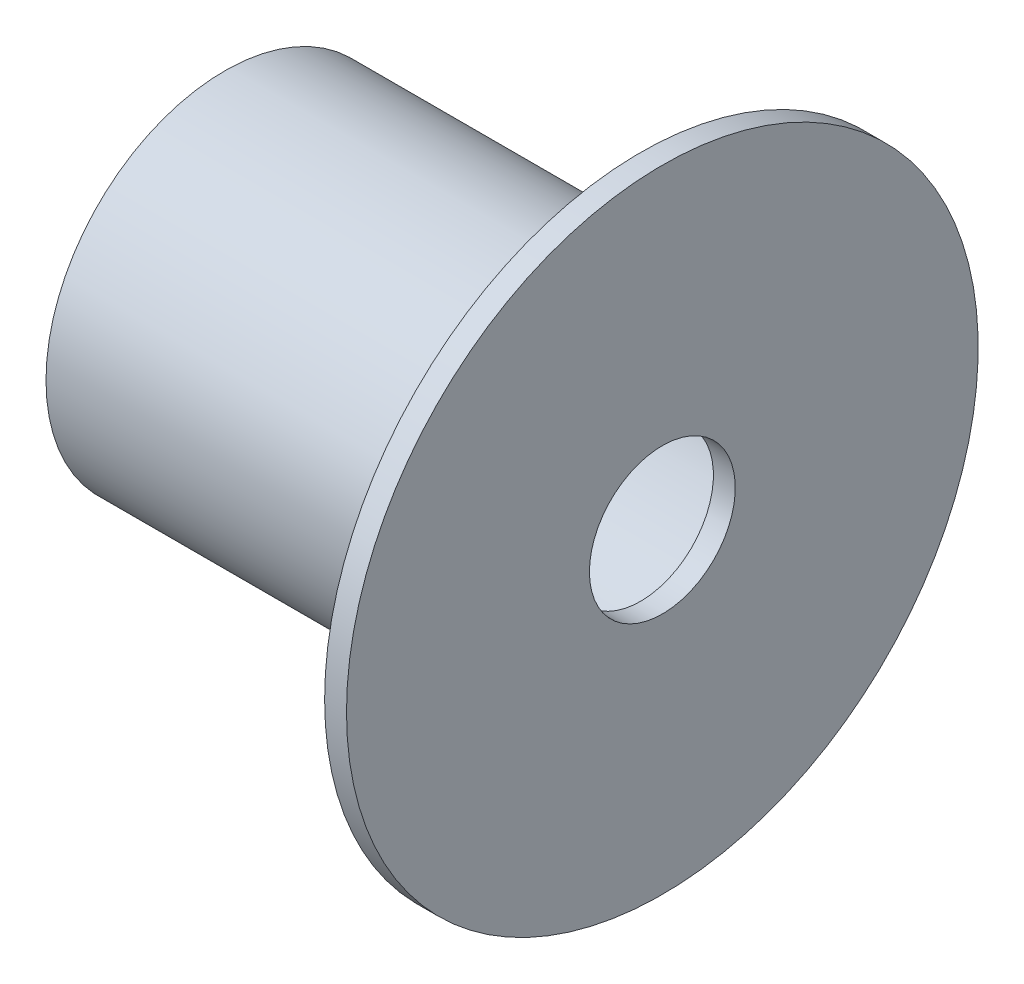
ISO-10303-21;
HEADER;
FILE_DESCRIPTION(('STEP AP214'),'2;1');
FILE_NAME('part.step','',(''),(''),'','','');
FILE_SCHEMA(('AUTOMOTIVE_DESIGN { 1 0 10303 214 1 1 1 1 }'));
ENDSEC;
DATA;
#1=APPLICATION_CONTEXT('core data for automotive mechanical design processes');
#2=APPLICATION_PROTOCOL_DEFINITION('international standard','automotive_design',2000,#1);
#3=PRODUCT_CONTEXT('',#1,'mechanical');
#4=PRODUCT('Part','Part','',(#3));
#5=PRODUCT_RELATED_PRODUCT_CATEGORY('part','',(#4));
#6=PRODUCT_DEFINITION_FORMATION('','',#4);
#7=PRODUCT_DEFINITION_CONTEXT('part definition',#1,'design');
#8=PRODUCT_DEFINITION('design','',#6,#7);
#9=PRODUCT_DEFINITION_SHAPE('','',#8);
#10=(LENGTH_UNIT() NAMED_UNIT(*) SI_UNIT(.MILLI.,.METRE.));
#11=(NAMED_UNIT(*) PLANE_ANGLE_UNIT() SI_UNIT($,.RADIAN.));
#12=(NAMED_UNIT(*) SI_UNIT($,.STERADIAN.) SOLID_ANGLE_UNIT());
#13=UNCERTAINTY_MEASURE_WITH_UNIT(LENGTH_MEASURE(1.E-05),#10,'distance_accuracy_value','');
#14=(GEOMETRIC_REPRESENTATION_CONTEXT(3) GLOBAL_UNCERTAINTY_ASSIGNED_CONTEXT((#13)) GLOBAL_UNIT_ASSIGNED_CONTEXT((#10,
#11,#12)) REPRESENTATION_CONTEXT('',''));
#15=CARTESIAN_POINT('',(0.,0.,0.));
#16=DIRECTION('',(0.,0.,1.));
#17=DIRECTION('',(1.,0.,0.));
#18=AXIS2_PLACEMENT_3D('',#15,#16,#17);
#19=CARTESIAN_POINT('',(25.4089068717293,7.90617287845862,0.));
#20=DIRECTION('',(1.,0.,0.));
#21=DIRECTION('',(0.,0.,-1.));
#22=AXIS2_PLACEMENT_3D('',#19,#20,#21);
#23=PLANE('',#22);
#24=CARTESIAN_POINT('',(25.4089068717294,-2.09382712154138,0.));
#25=DIRECTION('',(-1.,0.,0.));
#26=DIRECTION('',(0.,0.,1.));
#27=AXIS2_PLACEMENT_3D('',#24,#25,#26);
#28=CIRCLE('',#27,10.);
#29=CARTESIAN_POINT('',(25.4089068717294,-2.09382712154138,10.));
#30=VERTEX_POINT('',#29);
#31=EDGE_CURVE('E10',#30,#30,#28,.T.);
#32=ORIENTED_EDGE('',*,*,#31,.F.);
#33=EDGE_LOOP('',(#32));
#34=FACE_BOUND('',#33,.T.);
#35=CARTESIAN_POINT('',(25.4089068717294,-2.09382712154138,0.));
#36=DIRECTION('',(-1.,0.,0.));
#37=DIRECTION('',(0.,0.,1.));
#38=AXIS2_PLACEMENT_3D('',#35,#36,#37);
#39=CIRCLE('',#38,22.5077854027431);
#40=CARTESIAN_POINT('',(25.4089068717294,-2.09382712154138,22.5077854027431));
#41=VERTEX_POINT('',#40);
#42=EDGE_CURVE('E76',#41,#41,#39,.T.);
#43=ORIENTED_EDGE('',*,*,#42,.T.);
#44=EDGE_LOOP('',(#43));
#45=FACE_BOUND('',#44,.T.);
#46=ADVANCED_FACE('F41',(#34,#45),#23,.F.);
#47=CARTESIAN_POINT('',(-17.7626873949071,-2.09382712154138,0.));
#48=DIRECTION('',(-1.,0.,0.));
#49=DIRECTION('',(0.,0.,1.));
#50=AXIS2_PLACEMENT_3D('',#47,#48,#49);
#51=CYLINDRICAL_SURFACE('',#50,10.);
#52=CARTESIAN_POINT('',(28.4089068717293,-2.09382712154138,0.));
#53=DIRECTION('',(-1.,0.,0.));
#54=DIRECTION('',(0.,0.,1.));
#55=AXIS2_PLACEMENT_3D('',#52,#53,#54);
#56=CIRCLE('',#55,10.);
#57=CARTESIAN_POINT('',(28.4089068717293,-2.09382712154138,10.));
#58=VERTEX_POINT('',#57);
#59=EDGE_CURVE('E48',#58,#58,#56,.T.);
#60=ORIENTED_EDGE('',*,*,#59,.F.);
#61=EDGE_LOOP('',(#60));
#62=FACE_BOUND('',#61,.T.);
#63=ORIENTED_EDGE('',*,*,#31,.T.);
#64=EDGE_LOOP('',(#63));
#65=FACE_BOUND('',#64,.T.);
#66=ADVANCED_FACE('F114',(#62,#65),#51,.F.);
#67=CARTESIAN_POINT('',(28.4089068717293,7.90617287845862,0.));
#68=DIRECTION('',(-1.,0.,0.));
#69=DIRECTION('',(0.,0.,1.));
#70=AXIS2_PLACEMENT_3D('',#67,#68,#69);
#71=PLANE('',#70);
#72=CARTESIAN_POINT('',(28.4089068717293,-2.09382712154138,0.));
#73=DIRECTION('',(-1.,0.,0.));
#74=DIRECTION('',(0.,0.,1.));
#75=AXIS2_PLACEMENT_3D('',#72,#73,#74);
#76=CIRCLE('',#75,43.3072477435623);
#77=CARTESIAN_POINT('',(28.4089068717293,-2.09382712154138,43.3072477435623));
#78=VERTEX_POINT('',#77);
#79=EDGE_CURVE('E53',#78,#78,#76,.T.);
#80=ORIENTED_EDGE('',*,*,#79,.F.);
#81=EDGE_LOOP('',(#80));
#82=FACE_BOUND('',#81,.T.);
#83=ORIENTED_EDGE('',*,*,#59,.T.);
#84=EDGE_LOOP('',(#83));
#85=FACE_BOUND('',#84,.T.);
#86=ADVANCED_FACE('F109',(#82,#85),#71,.F.);
#87=CARTESIAN_POINT('',(-17.7626873949071,-2.09382712154138,0.));
#88=DIRECTION('',(-1.,0.,0.));
#89=DIRECTION('',(0.,0.,1.));
#90=AXIS2_PLACEMENT_3D('',#87,#88,#89);
#91=CYLINDRICAL_SURFACE('',#90,43.3072477435623);
#92=CARTESIAN_POINT('',(25.4089068717294,-2.09382712154138,0.));
#93=DIRECTION('',(-1.,0.,0.));
#94=DIRECTION('',(0.,0.,1.));
#95=AXIS2_PLACEMENT_3D('',#92,#93,#94);
#96=CIRCLE('',#95,43.3072477435623);
#97=CARTESIAN_POINT('',(25.4089068717294,-2.09382712154138,43.3072477435623));
#98=VERTEX_POINT('',#97);
#99=EDGE_CURVE('E58',#98,#98,#96,.T.);
#100=ORIENTED_EDGE('',*,*,#99,.F.);
#101=EDGE_LOOP('',(#100));
#102=FACE_BOUND('',#101,.T.);
#103=ORIENTED_EDGE('',*,*,#79,.T.);
#104=EDGE_LOOP('',(#103));
#105=FACE_BOUND('',#104,.T.);
#106=ADVANCED_FACE('F103',(#102,#105),#91,.T.);
#107=CARTESIAN_POINT('',(25.4089068717293,22.4139582812017,0.));
#108=DIRECTION('',(1.,0.,0.));
#109=DIRECTION('',(0.,0.,-1.));
#110=AXIS2_PLACEMENT_3D('',#107,#108,#109);
#111=PLANE('',#110);
#112=CARTESIAN_POINT('',(25.4089068717294,-2.09382712154138,0.));
#113=DIRECTION('',(-1.,0.,0.));
#114=DIRECTION('',(0.,0.,1.));
#115=AXIS2_PLACEMENT_3D('',#112,#113,#114);
#116=CIRCLE('',#115,24.5077854027431);
#117=CARTESIAN_POINT('',(25.4089068717294,-2.09382712154138,24.5077854027431));
#118=VERTEX_POINT('',#117);
#119=EDGE_CURVE('E64',#118,#118,#116,.T.);
#120=ORIENTED_EDGE('',*,*,#119,.F.);
#121=EDGE_LOOP('',(#120));
#122=FACE_BOUND('',#121,.T.);
#123=ORIENTED_EDGE('',*,*,#99,.T.);
#124=EDGE_LOOP('',(#123));
#125=FACE_BOUND('',#124,.T.);
#126=ADVANCED_FACE('F97',(#122,#125),#111,.F.);
#127=CARTESIAN_POINT('',(-17.7626873949071,-2.09382712154138,0.));
#128=DIRECTION('',(-1.,0.,0.));
#129=DIRECTION('',(0.,0.,1.));
#130=AXIS2_PLACEMENT_3D('',#127,#128,#129);
#131=CYLINDRICAL_SURFACE('',#130,24.5077854027431);
#132=CARTESIAN_POINT('',(-31.5910931282707,-2.09382712154138,0.));
#133=DIRECTION('',(-1.,0.,0.));
#134=DIRECTION('',(0.,0.,1.));
#135=AXIS2_PLACEMENT_3D('',#132,#133,#134);
#136=CIRCLE('',#135,24.507785402743);
#137=CARTESIAN_POINT('',(-31.5910931282707,-2.09382712154138,24.507785402743));
#138=VERTEX_POINT('',#137);
#139=EDGE_CURVE('E68',#138,#138,#136,.T.);
#140=ORIENTED_EDGE('',*,*,#139,.F.);
#141=EDGE_LOOP('',(#140));
#142=FACE_BOUND('',#141,.T.);
#143=ORIENTED_EDGE('',*,*,#119,.T.);
#144=EDGE_LOOP('',(#143));
#145=FACE_BOUND('',#144,.T.);
#146=ADVANCED_FACE('F91',(#142,#145),#131,.T.);
#147=CARTESIAN_POINT('',(-31.5910931282707,20.4139582812017,0.));
#148=DIRECTION('',(1.,0.,0.));
#149=DIRECTION('',(0.,0.,-1.));
#150=AXIS2_PLACEMENT_3D('',#147,#148,#149);
#151=PLANE('',#150);
#152=CARTESIAN_POINT('',(-31.5910931282707,-2.09382712154138,0.));
#153=DIRECTION('',(-1.,0.,0.));
#154=DIRECTION('',(0.,0.,1.));
#155=AXIS2_PLACEMENT_3D('',#152,#153,#154);
#156=CIRCLE('',#155,22.507785402743);
#157=CARTESIAN_POINT('',(-31.5910931282707,-2.09382712154138,22.507785402743));
#158=VERTEX_POINT('',#157);
#159=EDGE_CURVE('E72',#158,#158,#156,.T.);
#160=ORIENTED_EDGE('',*,*,#159,.F.);
#161=EDGE_LOOP('',(#160));
#162=FACE_BOUND('',#161,.T.);
#163=ORIENTED_EDGE('',*,*,#139,.T.);
#164=EDGE_LOOP('',(#163));
#165=FACE_BOUND('',#164,.T.);
#166=ADVANCED_FACE('F85',(#162,#165),#151,.F.);
#167=CARTESIAN_POINT('',(-17.7626873949071,-2.09382712154138,0.));
#168=DIRECTION('',(-1.,0.,0.));
#169=DIRECTION('',(0.,0.,1.));
#170=AXIS2_PLACEMENT_3D('',#167,#168,#169);
#171=CYLINDRICAL_SURFACE('',#170,22.5077854027431);
#172=ORIENTED_EDGE('',*,*,#42,.F.);
#173=EDGE_LOOP('',(#172));
#174=FACE_BOUND('',#173,.T.);
#175=ORIENTED_EDGE('',*,*,#159,.T.);
#176=EDGE_LOOP('',(#175));
#177=FACE_BOUND('',#176,.T.);
#178=ADVANCED_FACE('F82',(#174,#177),#171,.F.);
#179=CLOSED_SHELL('',(#46,#66,#86,#106,#126,#146,#166,#178));
#180=MANIFOLD_SOLID_BREP('B2',#179);
#181=ADVANCED_BREP_SHAPE_REPRESENTATION('',(#18,#180),#14);
#182=SHAPE_DEFINITION_REPRESENTATION(#9,#181);
ENDSEC;
END-ISO-10303-21;
